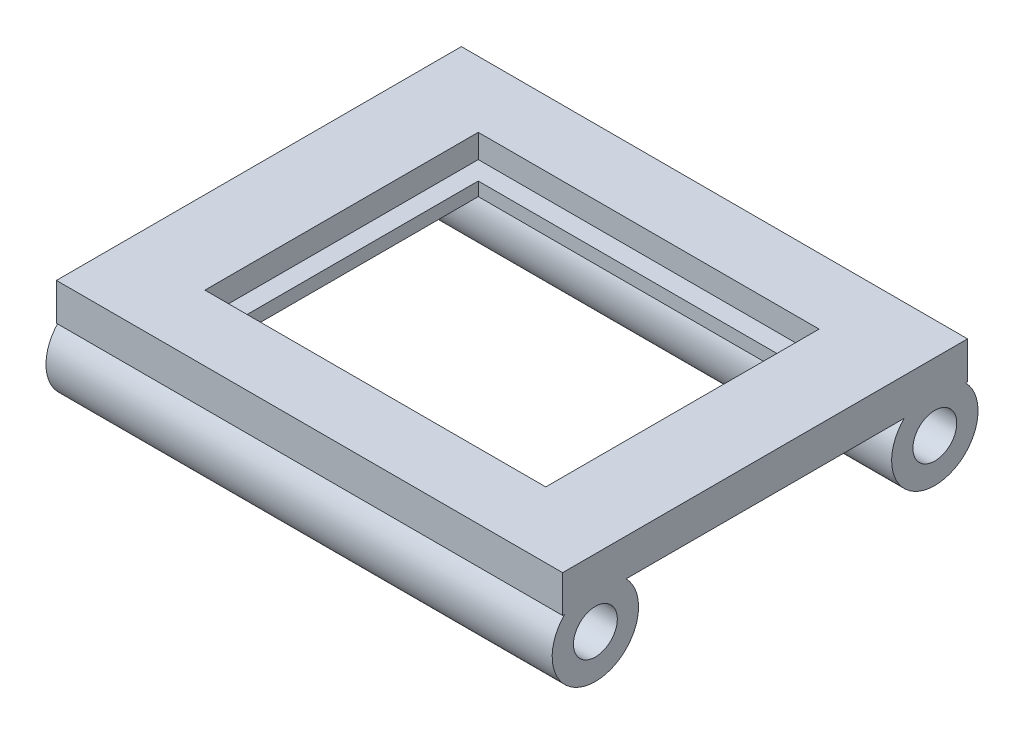
ISO-10303-21;
HEADER;
FILE_DESCRIPTION(('STEP AP214'),'2;1');
FILE_NAME('part.step','',(''),(''),'','','');
FILE_SCHEMA(('AUTOMOTIVE_DESIGN { 1 0 10303 214 1 1 1 1 }'));
ENDSEC;
DATA;
#1=APPLICATION_CONTEXT('core data for automotive mechanical design processes');
#2=APPLICATION_PROTOCOL_DEFINITION('international standard','automotive_design',2000,#1);
#3=PRODUCT_CONTEXT('',#1,'mechanical');
#4=PRODUCT('Part','Part','',(#3));
#5=PRODUCT_RELATED_PRODUCT_CATEGORY('part','',(#4));
#6=PRODUCT_DEFINITION_FORMATION('','',#4);
#7=PRODUCT_DEFINITION_CONTEXT('part definition',#1,'design');
#8=PRODUCT_DEFINITION('design','',#6,#7);
#9=PRODUCT_DEFINITION_SHAPE('','',#8);
#10=(LENGTH_UNIT() NAMED_UNIT(*) SI_UNIT(.MILLI.,.METRE.));
#11=(NAMED_UNIT(*) PLANE_ANGLE_UNIT() SI_UNIT($,.RADIAN.));
#12=(NAMED_UNIT(*) SI_UNIT($,.STERADIAN.) SOLID_ANGLE_UNIT());
#13=UNCERTAINTY_MEASURE_WITH_UNIT(LENGTH_MEASURE(1.E-05),#10,'distance_accuracy_value','');
#14=(GEOMETRIC_REPRESENTATION_CONTEXT(3) GLOBAL_UNCERTAINTY_ASSIGNED_CONTEXT((#13)) GLOBAL_UNIT_ASSIGNED_CONTEXT((#10,
#11,#12)) REPRESENTATION_CONTEXT('',''));
#15=CARTESIAN_POINT('',(0.,0.,0.));
#16=DIRECTION('',(0.,0.,1.));
#17=DIRECTION('',(1.,0.,0.));
#18=AXIS2_PLACEMENT_3D('',#15,#16,#17);
#19=CARTESIAN_POINT('',(0.,0.,0.));
#20=DIRECTION('',(0.,1.,0.));
#21=DIRECTION('',(0.,0.,1.));
#22=AXIS2_PLACEMENT_3D('',#19,#20,#21);
#23=PLANE('',#22);
#24=DIRECTION('',(-1.,0.,0.));
#25=VECTOR('',#24,1.);
#26=CARTESIAN_POINT('',(108.624395905354,0.,-59.3976482023862));
#27=LINE('',#26,#25);
#28=CARTESIAN_POINT('',(75.,0.,-59.3976482023862));
#29=VERTEX_POINT('',#28);
#30=CARTESIAN_POINT('',(-75.,0.,-59.3976482023862));
#31=VERTEX_POINT('',#30);
#32=EDGE_CURVE('E151',#29,#31,#27,.T.);
#33=ORIENTED_EDGE('',*,*,#32,.T.);
#34=DIRECTION('',(0.,0.,1.));
#35=VECTOR('',#34,1.);
#36=CARTESIAN_POINT('',(-75.,0.,-60.));
#37=LINE('',#36,#35);
#38=CARTESIAN_POINT('',(-75.,0.,-60.));
#39=VERTEX_POINT('',#38);
#40=EDGE_CURVE('E177',#39,#31,#37,.T.);
#41=ORIENTED_EDGE('',*,*,#40,.F.);
#42=DIRECTION('',(-1.,0.,0.));
#43=VECTOR('',#42,1.);
#44=CARTESIAN_POINT('',(-75.,0.,-60.));
#45=LINE('',#44,#43);
#46=CARTESIAN_POINT('',(75.,0.,-60.));
#47=VERTEX_POINT('',#46);
#48=EDGE_CURVE('E169',#47,#39,#45,.T.);
#49=ORIENTED_EDGE('',*,*,#48,.F.);
#50=DIRECTION('',(0.,0.,-1.));
#51=VECTOR('',#50,1.);
#52=CARTESIAN_POINT('',(75.,0.,-60.));
#53=LINE('',#52,#51);
#54=EDGE_CURVE('E167',#29,#47,#53,.T.);
#55=ORIENTED_EDGE('',*,*,#54,.F.);
#56=EDGE_LOOP('',(#33,#41,#49,#55));
#57=FACE_BOUND('',#56,.T.);
#58=ADVANCED_FACE('F32',(#57),#23,.F.);
#59=DIRECTION('',(1.,0.,0.));
#60=VECTOR('',#59,1.);
#61=CARTESIAN_POINT('',(-45.,0.,35.));
#62=LINE('',#61,#60);
#63=CARTESIAN_POINT('',(-45.,0.,35.));
#64=VERTEX_POINT('',#63);
#65=CARTESIAN_POINT('',(45.,0.,35.));
#66=VERTEX_POINT('',#65);
#67=EDGE_CURVE('E229',#64,#66,#62,.T.);
#68=ORIENTED_EDGE('',*,*,#67,.T.);
#69=DIRECTION('',(0.,0.,-1.));
#70=VECTOR('',#69,1.);
#71=CARTESIAN_POINT('',(45.,0.,-35.));
#72=LINE('',#71,#70);
#73=CARTESIAN_POINT('',(45.,0.,-35.));
#74=VERTEX_POINT('',#73);
#75=EDGE_CURVE('E219',#66,#74,#72,.T.);
#76=ORIENTED_EDGE('',*,*,#75,.T.);
#77=DIRECTION('',(-1.,0.,0.));
#78=VECTOR('',#77,1.);
#79=CARTESIAN_POINT('',(-45.,0.,-35.));
#80=LINE('',#79,#78);
#81=CARTESIAN_POINT('',(-45.,0.,-35.));
#82=VERTEX_POINT('',#81);
#83=EDGE_CURVE('E222',#74,#82,#80,.T.);
#84=ORIENTED_EDGE('',*,*,#83,.T.);
#85=DIRECTION('',(0.,0.,1.));
#86=VECTOR('',#85,1.);
#87=CARTESIAN_POINT('',(-45.,0.,-35.));
#88=LINE('',#87,#86);
#89=EDGE_CURVE('E226',#82,#64,#88,.T.);
#90=ORIENTED_EDGE('',*,*,#89,.T.);
#91=EDGE_LOOP('',(#68,#76,#84,#90));
#92=FACE_BOUND('',#91,.T.);
#93=DIRECTION('',(-1.,0.,0.));
#94=VECTOR('',#93,1.);
#95=CARTESIAN_POINT('',(108.624395905354,0.,-41.1943517976138));
#96=LINE('',#95,#94);
#97=CARTESIAN_POINT('',(75.,0.,-41.1943517976138));
#98=VERTEX_POINT('',#97);
#99=CARTESIAN_POINT('',(-75.,0.,-41.1943517976138));
#100=VERTEX_POINT('',#99);
#101=EDGE_CURVE('E148',#98,#100,#96,.T.);
#102=ORIENTED_EDGE('',*,*,#101,.F.);
#103=CARTESIAN_POINT('',(75.,0.,41.1943517976138));
#104=VERTEX_POINT('',#103);
#105=EDGE_CURVE('E160',#104,#98,#53,.T.);
#106=ORIENTED_EDGE('',*,*,#105,.F.);
#107=DIRECTION('',(-1.,0.,0.));
#108=VECTOR('',#107,1.);
#109=CARTESIAN_POINT('',(108.624395905354,0.,41.1943517976138));
#110=LINE('',#109,#108);
#111=CARTESIAN_POINT('',(-75.,0.,41.1943517976138));
#112=VERTEX_POINT('',#111);
#113=EDGE_CURVE('E55',#104,#112,#110,.T.);
#114=ORIENTED_EDGE('',*,*,#113,.T.);
#115=EDGE_CURVE('E161',#100,#112,#37,.T.);
#116=ORIENTED_EDGE('',*,*,#115,.F.);
#117=EDGE_LOOP('',(#102,#106,#114,#116));
#118=FACE_BOUND('',#117,.T.);
#119=ADVANCED_FACE('F159',(#92,#118),#23,.F.);
#120=CARTESIAN_POINT('',(75.,11.,-60.));
#121=DIRECTION('',(-1.,0.,0.));
#122=DIRECTION('',(0.,0.,1.));
#123=AXIS2_PLACEMENT_3D('',#120,#121,#122);
#124=PLANE('',#123);
#125=CARTESIAN_POINT('',(75.,0.,60.));
#126=VERTEX_POINT('',#125);
#127=CARTESIAN_POINT('',(75.,0.,59.3976482023862));
#128=VERTEX_POINT('',#127);
#129=EDGE_CURVE('E166',#126,#128,#53,.T.);
#130=ORIENTED_EDGE('',*,*,#129,.T.);
#131=CARTESIAN_POINT('',(75.,-9.,50.296));
#132=DIRECTION('',(-1.,0.,0.));
#133=DIRECTION('',(0.,0.,1.));
#134=AXIS2_PLACEMENT_3D('',#131,#132,#133);
#135=CIRCLE('',#134,12.8);
#136=EDGE_CURVE('E165',#128,#104,#135,.F.);
#137=ORIENTED_EDGE('',*,*,#136,.T.);
#138=ORIENTED_EDGE('',*,*,#105,.T.);
#139=CARTESIAN_POINT('',(75.,-9.,-50.296));
#140=DIRECTION('',(-1.,0.,0.));
#141=DIRECTION('',(0.,0.,1.));
#142=AXIS2_PLACEMENT_3D('',#139,#140,#141);
#143=CIRCLE('',#142,12.8);
#144=EDGE_CURVE('E145',#29,#98,#143,.T.);
#145=ORIENTED_EDGE('',*,*,#144,.F.);
#146=ORIENTED_EDGE('',*,*,#54,.T.);
#147=DIRECTION('',(0.,-1.,0.));
#148=VECTOR('',#147,1.);
#149=CARTESIAN_POINT('',(75.,11.,-60.));
#150=LINE('',#149,#148);
#151=CARTESIAN_POINT('',(75.,11.,-60.));
#152=VERTEX_POINT('',#151);
#153=EDGE_CURVE('E11',#152,#47,#150,.T.);
#154=ORIENTED_EDGE('',*,*,#153,.F.);
#155=DIRECTION('',(0.,0.,-1.));
#156=VECTOR('',#155,1.);
#157=CARTESIAN_POINT('',(75.,11.,-60.));
#158=LINE('',#157,#156);
#159=CARTESIAN_POINT('',(75.,11.,60.));
#160=VERTEX_POINT('',#159);
#161=EDGE_CURVE('E181',#160,#152,#158,.T.);
#162=ORIENTED_EDGE('',*,*,#161,.F.);
#163=DIRECTION('',(0.,-1.,0.));
#164=VECTOR('',#163,1.);
#165=CARTESIAN_POINT('',(75.,11.,60.));
#166=LINE('',#165,#164);
#167=EDGE_CURVE('E182',#160,#126,#166,.T.);
#168=ORIENTED_EDGE('',*,*,#167,.T.);
#169=EDGE_LOOP('',(#130,#137,#138,#145,#146,#154,#162,#168));
#170=FACE_BOUND('',#169,.T.);
#171=CARTESIAN_POINT('',(75.,-9.,50.296));
#172=DIRECTION('',(-1.,0.,0.));
#173=DIRECTION('',(0.,0.,1.));
#174=AXIS2_PLACEMENT_3D('',#171,#172,#173);
#175=CIRCLE('',#174,6.5);
#176=CARTESIAN_POINT('',(75.,-9.,56.796));
#177=VERTEX_POINT('',#176);
#178=EDGE_CURVE('E207',#177,#177,#175,.F.);
#179=ORIENTED_EDGE('',*,*,#178,.F.);
#180=EDGE_LOOP('',(#179));
#181=FACE_BOUND('',#180,.T.);
#182=CARTESIAN_POINT('',(75.,-9.,-50.296));
#183=DIRECTION('',(-1.,0.,0.));
#184=DIRECTION('',(0.,0.,1.));
#185=AXIS2_PLACEMENT_3D('',#182,#183,#184);
#186=CIRCLE('',#185,6.5);
#187=CARTESIAN_POINT('',(75.,-9.,-43.796));
#188=VERTEX_POINT('',#187);
#189=EDGE_CURVE('E198',#188,#188,#186,.T.);
#190=ORIENTED_EDGE('',*,*,#189,.T.);
#191=EDGE_LOOP('',(#190));
#192=FACE_BOUND('',#191,.T.);
#193=ADVANCED_FACE('F34',(#170,#181,#192),#124,.F.);
#194=CARTESIAN_POINT('',(-75.,11.,-60.));
#195=DIRECTION('',(0.,0.,1.));
#196=DIRECTION('',(1.,0.,0.));
#197=AXIS2_PLACEMENT_3D('',#194,#195,#196);
#198=PLANE('',#197);
#199=ORIENTED_EDGE('',*,*,#48,.T.);
#200=DIRECTION('',(0.,-1.,0.));
#201=VECTOR('',#200,1.);
#202=CARTESIAN_POINT('',(-75.,11.,-60.));
#203=LINE('',#202,#201);
#204=CARTESIAN_POINT('',(-75.,11.,-60.));
#205=VERTEX_POINT('',#204);
#206=EDGE_CURVE('E40',#205,#39,#203,.T.);
#207=ORIENTED_EDGE('',*,*,#206,.F.);
#208=DIRECTION('',(-1.,0.,0.));
#209=VECTOR('',#208,1.);
#210=CARTESIAN_POINT('',(-75.,11.,-60.));
#211=LINE('',#210,#209);
#212=EDGE_CURVE('E283',#152,#205,#211,.T.);
#213=ORIENTED_EDGE('',*,*,#212,.F.);
#214=ORIENTED_EDGE('',*,*,#153,.T.);
#215=EDGE_LOOP('',(#199,#207,#213,#214));
#216=FACE_BOUND('',#215,.T.);
#217=ADVANCED_FACE('F294',(#216),#198,.F.);
#218=CARTESIAN_POINT('',(-75.,11.,-60.));
#219=DIRECTION('',(1.,0.,0.));
#220=DIRECTION('',(0.,0.,-1.));
#221=AXIS2_PLACEMENT_3D('',#218,#219,#220);
#222=PLANE('',#221);
#223=ORIENTED_EDGE('',*,*,#40,.T.);
#224=CARTESIAN_POINT('',(-75.,-9.,-50.296));
#225=DIRECTION('',(1.,0.,0.));
#226=DIRECTION('',(0.,0.,-1.));
#227=AXIS2_PLACEMENT_3D('',#224,#225,#226);
#228=CIRCLE('',#227,12.8);
#229=EDGE_CURVE('E47',#100,#31,#228,.T.);
#230=ORIENTED_EDGE('',*,*,#229,.F.);
#231=ORIENTED_EDGE('',*,*,#115,.T.);
#232=CARTESIAN_POINT('',(-75.,-9.,50.296));
#233=DIRECTION('',(-1.,0.,0.));
#234=DIRECTION('',(0.,0.,1.));
#235=AXIS2_PLACEMENT_3D('',#232,#233,#234);
#236=CIRCLE('',#235,12.8);
#237=CARTESIAN_POINT('',(-75.,0.,59.3976482023862));
#238=VERTEX_POINT('',#237);
#239=EDGE_CURVE('E210',#112,#238,#236,.T.);
#240=ORIENTED_EDGE('',*,*,#239,.T.);
#241=CARTESIAN_POINT('',(-75.,0.,60.));
#242=VERTEX_POINT('',#241);
#243=EDGE_CURVE('E176',#238,#242,#37,.T.);
#244=ORIENTED_EDGE('',*,*,#243,.T.);
#245=DIRECTION('',(0.,-1.,0.));
#246=VECTOR('',#245,1.);
#247=CARTESIAN_POINT('',(-75.,11.,60.));
#248=LINE('',#247,#246);
#249=CARTESIAN_POINT('',(-75.,11.,60.));
#250=VERTEX_POINT('',#249);
#251=EDGE_CURVE('E185',#250,#242,#248,.T.);
#252=ORIENTED_EDGE('',*,*,#251,.F.);
#253=DIRECTION('',(0.,0.,1.));
#254=VECTOR('',#253,1.);
#255=CARTESIAN_POINT('',(-75.,11.,-60.));
#256=LINE('',#255,#254);
#257=EDGE_CURVE('E194',#205,#250,#256,.T.);
#258=ORIENTED_EDGE('',*,*,#257,.F.);
#259=ORIENTED_EDGE('',*,*,#206,.T.);
#260=EDGE_LOOP('',(#223,#230,#231,#240,#244,#252,#258,#259));
#261=FACE_BOUND('',#260,.T.);
#262=CARTESIAN_POINT('',(-75.,-9.,50.296));
#263=DIRECTION('',(-1.,0.,0.));
#264=DIRECTION('',(0.,0.,1.));
#265=AXIS2_PLACEMENT_3D('',#262,#263,#264);
#266=CIRCLE('',#265,6.5);
#267=CARTESIAN_POINT('',(-75.,-9.,56.796));
#268=VERTEX_POINT('',#267);
#269=EDGE_CURVE('E201',#268,#268,#266,.T.);
#270=ORIENTED_EDGE('',*,*,#269,.F.);
#271=EDGE_LOOP('',(#270));
#272=FACE_BOUND('',#271,.T.);
#273=CARTESIAN_POINT('',(-75.,-9.,-50.296));
#274=DIRECTION('',(1.,0.,0.));
#275=DIRECTION('',(0.,0.,-1.));
#276=AXIS2_PLACEMENT_3D('',#273,#274,#275);
#277=CIRCLE('',#276,6.5);
#278=CARTESIAN_POINT('',(-75.,-9.,-56.796));
#279=VERTEX_POINT('',#278);
#280=EDGE_CURVE('E155',#279,#279,#277,.T.);
#281=ORIENTED_EDGE('',*,*,#280,.T.);
#282=EDGE_LOOP('',(#281));
#283=FACE_BOUND('',#282,.T.);
#284=ADVANCED_FACE('F191',(#261,#272,#283),#222,.F.);
#285=CARTESIAN_POINT('',(-75.,11.,60.));
#286=DIRECTION('',(0.,0.,-1.));
#287=DIRECTION('',(-1.,0.,0.));
#288=AXIS2_PLACEMENT_3D('',#285,#286,#287);
#289=PLANE('',#288);
#290=DIRECTION('',(1.,0.,0.));
#291=VECTOR('',#290,1.);
#292=CARTESIAN_POINT('',(-75.,0.,60.));
#293=LINE('',#292,#291);
#294=EDGE_CURVE('E179',#242,#126,#293,.T.);
#295=ORIENTED_EDGE('',*,*,#294,.T.);
#296=ORIENTED_EDGE('',*,*,#167,.F.);
#297=DIRECTION('',(1.,0.,0.));
#298=VECTOR('',#297,1.);
#299=CARTESIAN_POINT('',(-75.,11.,60.));
#300=LINE('',#299,#298);
#301=EDGE_CURVE('E173',#250,#160,#300,.T.);
#302=ORIENTED_EDGE('',*,*,#301,.F.);
#303=ORIENTED_EDGE('',*,*,#251,.T.);
#304=EDGE_LOOP('',(#295,#296,#302,#303));
#305=FACE_BOUND('',#304,.T.);
#306=ADVANCED_FACE('F291',(#305),#289,.F.);
#307=CARTESIAN_POINT('',(0.,11.,0.));
#308=DIRECTION('',(0.,1.,0.));
#309=DIRECTION('',(0.,0.,1.));
#310=AXIS2_PLACEMENT_3D('',#307,#308,#309);
#311=PLANE('',#310);
#312=DIRECTION('',(0.,0.,-1.));
#313=VECTOR('',#312,1.);
#314=CARTESIAN_POINT('',(50.5,11.,-40.5));
#315=LINE('',#314,#313);
#316=CARTESIAN_POINT('',(50.5,11.,40.5));
#317=VERTEX_POINT('',#316);
#318=CARTESIAN_POINT('',(50.5,11.,-40.5));
#319=VERTEX_POINT('',#318);
#320=EDGE_CURVE('E244',#317,#319,#315,.T.);
#321=ORIENTED_EDGE('',*,*,#320,.F.);
#322=DIRECTION('',(1.,0.,0.));
#323=VECTOR('',#322,1.);
#324=CARTESIAN_POINT('',(-50.5,11.,40.5));
#325=LINE('',#324,#323);
#326=CARTESIAN_POINT('',(-50.5,11.,40.5));
#327=VERTEX_POINT('',#326);
#328=EDGE_CURVE('E255',#327,#317,#325,.T.);
#329=ORIENTED_EDGE('',*,*,#328,.F.);
#330=DIRECTION('',(0.,0.,1.));
#331=VECTOR('',#330,1.);
#332=CARTESIAN_POINT('',(-50.5,11.,-40.5));
#333=LINE('',#332,#331);
#334=CARTESIAN_POINT('',(-50.5,11.,-40.5));
#335=VERTEX_POINT('',#334);
#336=EDGE_CURVE('E269',#335,#327,#333,.T.);
#337=ORIENTED_EDGE('',*,*,#336,.F.);
#338=DIRECTION('',(-1.,0.,0.));
#339=VECTOR('',#338,1.);
#340=CARTESIAN_POINT('',(-50.5,11.,-40.5));
#341=LINE('',#340,#339);
#342=EDGE_CURVE('E266',#319,#335,#341,.T.);
#343=ORIENTED_EDGE('',*,*,#342,.F.);
#344=EDGE_LOOP('',(#321,#329,#337,#343));
#345=FACE_BOUND('',#344,.T.);
#346=ORIENTED_EDGE('',*,*,#161,.T.);
#347=ORIENTED_EDGE('',*,*,#212,.T.);
#348=ORIENTED_EDGE('',*,*,#257,.T.);
#349=ORIENTED_EDGE('',*,*,#301,.T.);
#350=EDGE_LOOP('',(#346,#347,#348,#349));
#351=FACE_BOUND('',#350,.T.);
#352=ADVANCED_FACE('F287',(#345,#351),#311,.T.);
#353=ORIENTED_EDGE('',*,*,#243,.F.);
#354=DIRECTION('',(-1.,0.,0.));
#355=VECTOR('',#354,1.);
#356=CARTESIAN_POINT('',(108.624395905354,0.,59.3976482023862));
#357=LINE('',#356,#355);
#358=EDGE_CURVE('E213',#128,#238,#357,.T.);
#359=ORIENTED_EDGE('',*,*,#358,.F.);
#360=ORIENTED_EDGE('',*,*,#129,.F.);
#361=ORIENTED_EDGE('',*,*,#294,.F.);
#362=EDGE_LOOP('',(#353,#359,#360,#361));
#363=FACE_BOUND('',#362,.T.);
#364=ADVANCED_FACE('F303',(#363),#23,.F.);
#365=CARTESIAN_POINT('',(50.5,4.,-40.5));
#366=DIRECTION('',(1.,0.,0.));
#367=DIRECTION('',(0.,0.,-1.));
#368=AXIS2_PLACEMENT_3D('',#365,#366,#367);
#369=PLANE('',#368);
#370=ORIENTED_EDGE('',*,*,#320,.T.);
#371=DIRECTION('',(0.,1.,0.));
#372=VECTOR('',#371,1.);
#373=CARTESIAN_POINT('',(50.5,4.,-40.5));
#374=LINE('',#373,#372);
#375=CARTESIAN_POINT('',(50.5,4.,-40.5));
#376=VERTEX_POINT('',#375);
#377=EDGE_CURVE('E264',#376,#319,#374,.T.);
#378=ORIENTED_EDGE('',*,*,#377,.F.);
#379=DIRECTION('',(0.,0.,-1.));
#380=VECTOR('',#379,1.);
#381=CARTESIAN_POINT('',(50.5,4.,-40.5));
#382=LINE('',#381,#380);
#383=CARTESIAN_POINT('',(50.5,4.,40.5));
#384=VERTEX_POINT('',#383);
#385=EDGE_CURVE('E251',#384,#376,#382,.T.);
#386=ORIENTED_EDGE('',*,*,#385,.F.);
#387=DIRECTION('',(0.,1.,0.));
#388=VECTOR('',#387,1.);
#389=CARTESIAN_POINT('',(50.5,4.,40.5));
#390=LINE('',#389,#388);
#391=EDGE_CURVE('E170',#384,#317,#390,.T.);
#392=ORIENTED_EDGE('',*,*,#391,.T.);
#393=EDGE_LOOP('',(#370,#378,#386,#392));
#394=FACE_BOUND('',#393,.T.);
#395=ADVANCED_FACE('F311',(#394),#369,.F.);
#396=CARTESIAN_POINT('',(-50.5,4.,40.5));
#397=DIRECTION('',(0.,0.,1.));
#398=DIRECTION('',(1.,0.,0.));
#399=AXIS2_PLACEMENT_3D('',#396,#397,#398);
#400=PLANE('',#399);
#401=ORIENTED_EDGE('',*,*,#328,.T.);
#402=ORIENTED_EDGE('',*,*,#391,.F.);
#403=DIRECTION('',(1.,0.,0.));
#404=VECTOR('',#403,1.);
#405=CARTESIAN_POINT('',(-50.5,4.,40.5));
#406=LINE('',#405,#404);
#407=CARTESIAN_POINT('',(-50.5,4.,40.5));
#408=VERTEX_POINT('',#407);
#409=EDGE_CURVE('E261',#408,#384,#406,.T.);
#410=ORIENTED_EDGE('',*,*,#409,.F.);
#411=DIRECTION('',(0.,1.,0.));
#412=VECTOR('',#411,1.);
#413=CARTESIAN_POINT('',(-50.5,4.,40.5));
#414=LINE('',#413,#412);
#415=EDGE_CURVE('E275',#408,#327,#414,.T.);
#416=ORIENTED_EDGE('',*,*,#415,.T.);
#417=EDGE_LOOP('',(#401,#402,#410,#416));
#418=FACE_BOUND('',#417,.T.);
#419=ADVANCED_FACE('F317',(#418),#400,.F.);
#420=CARTESIAN_POINT('',(-50.5,4.,-40.5));
#421=DIRECTION('',(-1.,0.,0.));
#422=DIRECTION('',(0.,0.,1.));
#423=AXIS2_PLACEMENT_3D('',#420,#421,#422);
#424=PLANE('',#423);
#425=ORIENTED_EDGE('',*,*,#336,.T.);
#426=ORIENTED_EDGE('',*,*,#415,.F.);
#427=DIRECTION('',(0.,0.,1.));
#428=VECTOR('',#427,1.);
#429=CARTESIAN_POINT('',(-50.5,4.,-40.5));
#430=LINE('',#429,#428);
#431=CARTESIAN_POINT('',(-50.5,4.,-40.5));
#432=VERTEX_POINT('',#431);
#433=EDGE_CURVE('E258',#432,#408,#430,.T.);
#434=ORIENTED_EDGE('',*,*,#433,.F.);
#435=DIRECTION('',(0.,1.,0.));
#436=VECTOR('',#435,1.);
#437=CARTESIAN_POINT('',(-50.5,4.,-40.5));
#438=LINE('',#437,#436);
#439=EDGE_CURVE('E277',#432,#335,#438,.T.);
#440=ORIENTED_EDGE('',*,*,#439,.T.);
#441=EDGE_LOOP('',(#425,#426,#434,#440));
#442=FACE_BOUND('',#441,.T.);
#443=ADVANCED_FACE('F357',(#442),#424,.F.);
#444=CARTESIAN_POINT('',(-50.5,4.,-40.5));
#445=DIRECTION('',(0.,0.,-1.));
#446=DIRECTION('',(-1.,0.,0.));
#447=AXIS2_PLACEMENT_3D('',#444,#445,#446);
#448=PLANE('',#447);
#449=ORIENTED_EDGE('',*,*,#342,.T.);
#450=ORIENTED_EDGE('',*,*,#439,.F.);
#451=DIRECTION('',(-1.,0.,0.));
#452=VECTOR('',#451,1.);
#453=CARTESIAN_POINT('',(-50.5,4.,-40.5));
#454=LINE('',#453,#452);
#455=EDGE_CURVE('E254',#376,#432,#454,.T.);
#456=ORIENTED_EDGE('',*,*,#455,.F.);
#457=ORIENTED_EDGE('',*,*,#377,.T.);
#458=EDGE_LOOP('',(#449,#450,#456,#457));
#459=FACE_BOUND('',#458,.T.);
#460=ADVANCED_FACE('F353',(#459),#448,.F.);
#461=CARTESIAN_POINT('',(0.,4.,0.));
#462=DIRECTION('',(0.,1.,0.));
#463=DIRECTION('',(0.,0.,1.));
#464=AXIS2_PLACEMENT_3D('',#461,#462,#463);
#465=PLANE('',#464);
#466=DIRECTION('',(0.,0.,-1.));
#467=VECTOR('',#466,1.);
#468=CARTESIAN_POINT('',(45.,4.,-35.));
#469=LINE('',#468,#467);
#470=CARTESIAN_POINT('',(45.,4.,35.));
#471=VERTEX_POINT('',#470);
#472=CARTESIAN_POINT('',(45.,4.,-35.));
#473=VERTEX_POINT('',#472);
#474=EDGE_CURVE('E218',#471,#473,#469,.T.);
#475=ORIENTED_EDGE('',*,*,#474,.F.);
#476=DIRECTION('',(1.,0.,0.));
#477=VECTOR('',#476,1.);
#478=CARTESIAN_POINT('',(-45.,4.,35.));
#479=LINE('',#478,#477);
#480=CARTESIAN_POINT('',(-45.,4.,35.));
#481=VERTEX_POINT('',#480);
#482=EDGE_CURVE('E223',#481,#471,#479,.T.);
#483=ORIENTED_EDGE('',*,*,#482,.F.);
#484=DIRECTION('',(0.,0.,1.));
#485=VECTOR('',#484,1.);
#486=CARTESIAN_POINT('',(-45.,4.,-35.));
#487=LINE('',#486,#485);
#488=CARTESIAN_POINT('',(-45.,4.,-35.));
#489=VERTEX_POINT('',#488);
#490=EDGE_CURVE('E238',#489,#481,#487,.T.);
#491=ORIENTED_EDGE('',*,*,#490,.F.);
#492=DIRECTION('',(-1.,0.,0.));
#493=VECTOR('',#492,1.);
#494=CARTESIAN_POINT('',(-45.,4.,-35.));
#495=LINE('',#494,#493);
#496=EDGE_CURVE('E235',#473,#489,#495,.T.);
#497=ORIENTED_EDGE('',*,*,#496,.F.);
#498=EDGE_LOOP('',(#475,#483,#491,#497));
#499=FACE_BOUND('',#498,.T.);
#500=ORIENTED_EDGE('',*,*,#385,.T.);
#501=ORIENTED_EDGE('',*,*,#455,.T.);
#502=ORIENTED_EDGE('',*,*,#433,.T.);
#503=ORIENTED_EDGE('',*,*,#409,.T.);
#504=EDGE_LOOP('',(#500,#501,#502,#503));
#505=FACE_BOUND('',#504,.T.);
#506=ADVANCED_FACE('F349',(#499,#505),#465,.T.);
#507=CARTESIAN_POINT('',(45.,0.,-35.));
#508=DIRECTION('',(1.,0.,0.));
#509=DIRECTION('',(0.,0.,-1.));
#510=AXIS2_PLACEMENT_3D('',#507,#508,#509);
#511=PLANE('',#510);
#512=ORIENTED_EDGE('',*,*,#474,.T.);
#513=DIRECTION('',(0.,1.,0.));
#514=VECTOR('',#513,1.);
#515=CARTESIAN_POINT('',(45.,0.,-35.));
#516=LINE('',#515,#514);
#517=EDGE_CURVE('E232',#74,#473,#516,.T.);
#518=ORIENTED_EDGE('',*,*,#517,.F.);
#519=ORIENTED_EDGE('',*,*,#75,.F.);
#520=DIRECTION('',(0.,1.,0.));
#521=VECTOR('',#520,1.);
#522=CARTESIAN_POINT('',(45.,0.,35.));
#523=LINE('',#522,#521);
#524=EDGE_CURVE('E242',#66,#471,#523,.T.);
#525=ORIENTED_EDGE('',*,*,#524,.T.);
#526=EDGE_LOOP('',(#512,#518,#519,#525));
#527=FACE_BOUND('',#526,.T.);
#528=ADVANCED_FACE('F342',(#527),#511,.F.);
#529=CARTESIAN_POINT('',(-45.,0.,35.));
#530=DIRECTION('',(0.,0.,1.));
#531=DIRECTION('',(1.,0.,0.));
#532=AXIS2_PLACEMENT_3D('',#529,#530,#531);
#533=PLANE('',#532);
#534=ORIENTED_EDGE('',*,*,#482,.T.);
#535=ORIENTED_EDGE('',*,*,#524,.F.);
#536=ORIENTED_EDGE('',*,*,#67,.F.);
#537=DIRECTION('',(0.,1.,0.));
#538=VECTOR('',#537,1.);
#539=CARTESIAN_POINT('',(-45.,0.,35.));
#540=LINE('',#539,#538);
#541=EDGE_CURVE('E245',#64,#481,#540,.T.);
#542=ORIENTED_EDGE('',*,*,#541,.T.);
#543=EDGE_LOOP('',(#534,#535,#536,#542));
#544=FACE_BOUND('',#543,.T.);
#545=ADVANCED_FACE('F339',(#544),#533,.F.);
#546=CARTESIAN_POINT('',(-45.,0.,-35.));
#547=DIRECTION('',(-1.,0.,0.));
#548=DIRECTION('',(0.,0.,1.));
#549=AXIS2_PLACEMENT_3D('',#546,#547,#548);
#550=PLANE('',#549);
#551=ORIENTED_EDGE('',*,*,#490,.T.);
#552=ORIENTED_EDGE('',*,*,#541,.F.);
#553=ORIENTED_EDGE('',*,*,#89,.F.);
#554=DIRECTION('',(0.,1.,0.));
#555=VECTOR('',#554,1.);
#556=CARTESIAN_POINT('',(-45.,0.,-35.));
#557=LINE('',#556,#555);
#558=EDGE_CURVE('E248',#82,#489,#557,.T.);
#559=ORIENTED_EDGE('',*,*,#558,.T.);
#560=EDGE_LOOP('',(#551,#552,#553,#559));
#561=FACE_BOUND('',#560,.T.);
#562=ADVANCED_FACE('F334',(#561),#550,.F.);
#563=CARTESIAN_POINT('',(-45.,0.,-35.));
#564=DIRECTION('',(0.,0.,-1.));
#565=DIRECTION('',(-1.,0.,0.));
#566=AXIS2_PLACEMENT_3D('',#563,#564,#565);
#567=PLANE('',#566);
#568=ORIENTED_EDGE('',*,*,#496,.T.);
#569=ORIENTED_EDGE('',*,*,#558,.F.);
#570=ORIENTED_EDGE('',*,*,#83,.F.);
#571=ORIENTED_EDGE('',*,*,#517,.T.);
#572=EDGE_LOOP('',(#568,#569,#570,#571));
#573=FACE_BOUND('',#572,.T.);
#574=ADVANCED_FACE('F326',(#573),#567,.F.);
#575=CARTESIAN_POINT('',(108.624395905354,-9.,50.296));
#576=DIRECTION('',(-1.,0.,0.));
#577=DIRECTION('',(0.,0.,1.));
#578=AXIS2_PLACEMENT_3D('',#575,#576,#577);
#579=CYLINDRICAL_SURFACE('',#578,12.8);
#580=ORIENTED_EDGE('',*,*,#136,.F.);
#581=ORIENTED_EDGE('',*,*,#358,.T.);
#582=ORIENTED_EDGE('',*,*,#239,.F.);
#583=ORIENTED_EDGE('',*,*,#113,.F.);
#584=EDGE_LOOP('',(#580,#581,#582,#583));
#585=FACE_BOUND('',#584,.T.);
#586=ADVANCED_FACE('F323',(#585),#579,.T.);
#587=CARTESIAN_POINT('',(108.624395905354,-9.,50.296));
#588=DIRECTION('',(-1.,0.,0.));
#589=DIRECTION('',(0.,0.,1.));
#590=AXIS2_PLACEMENT_3D('',#587,#588,#589);
#591=CYLINDRICAL_SURFACE('',#590,6.5);
#592=ORIENTED_EDGE('',*,*,#178,.T.);
#593=EDGE_LOOP('',(#592));
#594=FACE_BOUND('',#593,.T.);
#595=ORIENTED_EDGE('',*,*,#269,.T.);
#596=EDGE_LOOP('',(#595));
#597=FACE_BOUND('',#596,.T.);
#598=ADVANCED_FACE('F325',(#594,#597),#591,.F.);
#599=CARTESIAN_POINT('',(108.624395905354,-9.,-50.296));
#600=DIRECTION('',(-1.,0.,0.));
#601=DIRECTION('',(0.,0.,1.));
#602=AXIS2_PLACEMENT_3D('',#599,#600,#601);
#603=CYLINDRICAL_SURFACE('',#602,12.8);
#604=ORIENTED_EDGE('',*,*,#32,.F.);
#605=ORIENTED_EDGE('',*,*,#144,.T.);
#606=ORIENTED_EDGE('',*,*,#101,.T.);
#607=ORIENTED_EDGE('',*,*,#229,.T.);
#608=EDGE_LOOP('',(#604,#605,#606,#607));
#609=FACE_BOUND('',#608,.T.);
#610=ADVANCED_FACE('F147',(#609),#603,.T.);
#611=CARTESIAN_POINT('',(108.624395905354,-9.,-50.296));
#612=DIRECTION('',(-1.,0.,0.));
#613=DIRECTION('',(0.,0.,1.));
#614=AXIS2_PLACEMENT_3D('',#611,#612,#613);
#615=CYLINDRICAL_SURFACE('',#614,6.5);
#616=ORIENTED_EDGE('',*,*,#189,.F.);
#617=EDGE_LOOP('',(#616));
#618=FACE_BOUND('',#617,.T.);
#619=ORIENTED_EDGE('',*,*,#280,.F.);
#620=EDGE_LOOP('',(#619));
#621=FACE_BOUND('',#620,.T.);
#622=ADVANCED_FACE('F447',(#618,#621),#615,.F.);
#623=CLOSED_SHELL('',(#58,#119,#193,#217,#284,#306,#352,#364,#395,#419,#443,#460,#506,#528,#545,
#562,#574,#586,#598,#610,#622));
#624=MANIFOLD_SOLID_BREP('B2',#623);
#625=ADVANCED_BREP_SHAPE_REPRESENTATION('',(#18,#624),#14);
#626=SHAPE_DEFINITION_REPRESENTATION(#9,#625);
ENDSEC;
END-ISO-10303-21;
